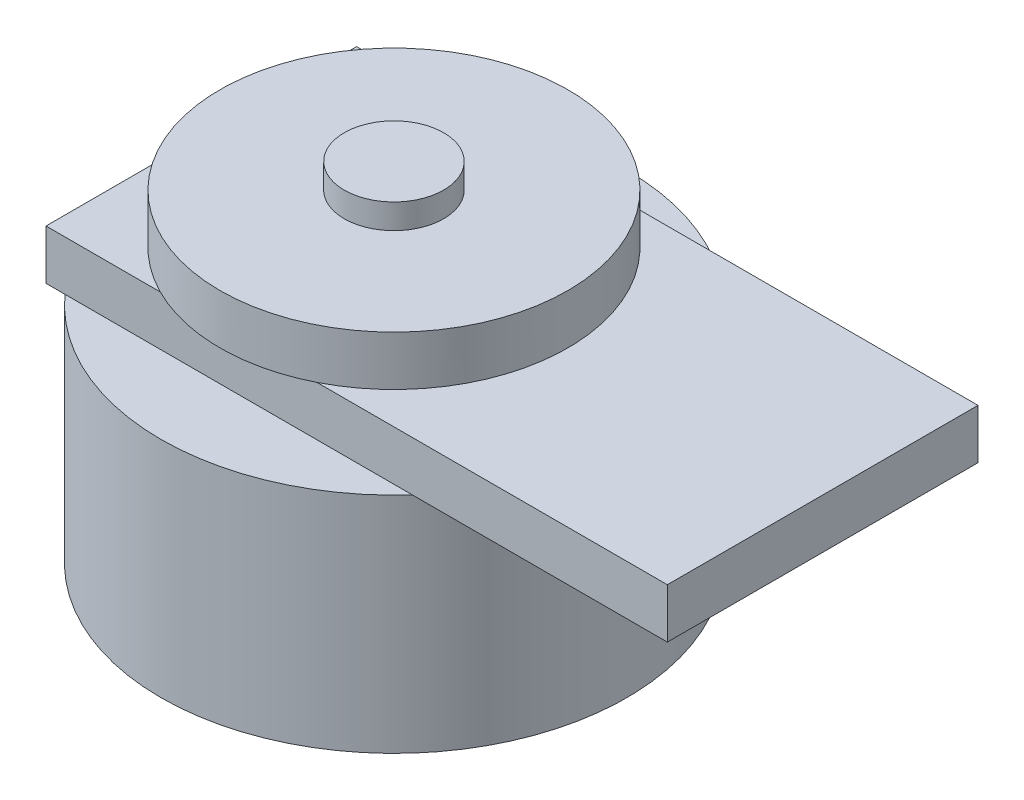
ISO-10303-21;
HEADER;
FILE_DESCRIPTION(('STEP AP214'),'2;1');
FILE_NAME('part.step','',(''),(''),'','','');
FILE_SCHEMA(('AUTOMOTIVE_DESIGN { 1 0 10303 214 1 1 1 1 }'));
ENDSEC;
DATA;
#1=APPLICATION_CONTEXT('core data for automotive mechanical design processes');
#2=APPLICATION_PROTOCOL_DEFINITION('international standard','automotive_design',2000,#1);
#3=PRODUCT_CONTEXT('',#1,'mechanical');
#4=PRODUCT('Part','Part','',(#3));
#5=PRODUCT_RELATED_PRODUCT_CATEGORY('part','',(#4));
#6=PRODUCT_DEFINITION_FORMATION('','',#4);
#7=PRODUCT_DEFINITION_CONTEXT('part definition',#1,'design');
#8=PRODUCT_DEFINITION('design','',#6,#7);
#9=PRODUCT_DEFINITION_SHAPE('','',#8);
#10=(LENGTH_UNIT() NAMED_UNIT(*) SI_UNIT(.MILLI.,.METRE.));
#11=(NAMED_UNIT(*) PLANE_ANGLE_UNIT() SI_UNIT($,.RADIAN.));
#12=(NAMED_UNIT(*) SI_UNIT($,.STERADIAN.) SOLID_ANGLE_UNIT());
#13=UNCERTAINTY_MEASURE_WITH_UNIT(LENGTH_MEASURE(1.E-05),#10,'distance_accuracy_value','');
#14=(GEOMETRIC_REPRESENTATION_CONTEXT(3) GLOBAL_UNCERTAINTY_ASSIGNED_CONTEXT((#13)) GLOBAL_UNIT_ASSIGNED_CONTEXT((#10,
#11,#12)) REPRESENTATION_CONTEXT('',''));
#15=CARTESIAN_POINT('',(0.,0.,0.));
#16=DIRECTION('',(0.,0.,1.));
#17=DIRECTION('',(1.,0.,0.));
#18=AXIS2_PLACEMENT_3D('',#15,#16,#17);
#19=CARTESIAN_POINT('',(0.,0.,0.));
#20=DIRECTION('',(0.,-1.,0.));
#21=DIRECTION('',(0.,0.,-1.));
#22=AXIS2_PLACEMENT_3D('',#19,#20,#21);
#23=PLANE('',#22);
#24=CARTESIAN_POINT('',(-9.5,0.,0.));
#25=DIRECTION('',(0.,-1.,0.));
#26=DIRECTION('',(0.,0.,-1.));
#27=AXIS2_PLACEMENT_3D('',#24,#25,#26);
#28=CIRCLE('',#27,18.75);
#29=CARTESIAN_POINT('',(4.47542485937369,0.,-12.5));
#30=VERTEX_POINT('',#29);
#31=CARTESIAN_POINT('',(4.47542485937369,0.,12.5));
#32=VERTEX_POINT('',#31);
#33=EDGE_CURVE('E138',#30,#32,#28,.T.);
#34=ORIENTED_EDGE('',*,*,#33,.F.);
#35=DIRECTION('',(-1.,0.,0.));
#36=VECTOR('',#35,1.);
#37=CARTESIAN_POINT('',(25.,0.,-12.5));
#38=LINE('',#37,#36);
#39=CARTESIAN_POINT('',(25.,0.,-12.5));
#40=VERTEX_POINT('',#39);
#41=EDGE_CURVE('E122',#40,#30,#38,.T.);
#42=ORIENTED_EDGE('',*,*,#41,.F.);
#43=DIRECTION('',(0.,0.,-1.));
#44=VECTOR('',#43,1.);
#45=CARTESIAN_POINT('',(25.,0.,12.5));
#46=LINE('',#45,#44);
#47=CARTESIAN_POINT('',(25.,0.,12.5));
#48=VERTEX_POINT('',#47);
#49=EDGE_CURVE('E173',#48,#40,#46,.T.);
#50=ORIENTED_EDGE('',*,*,#49,.F.);
#51=DIRECTION('',(-1.,0.,0.));
#52=VECTOR('',#51,1.);
#53=CARTESIAN_POINT('',(25.,0.,12.5));
#54=LINE('',#53,#52);
#55=EDGE_CURVE('E168',#48,#32,#54,.T.);
#56=ORIENTED_EDGE('',*,*,#55,.T.);
#57=EDGE_LOOP('',(#34,#42,#50,#56));
#58=FACE_BOUND('',#57,.T.);
#59=ADVANCED_FACE('F39',(#58),#23,.T.);
#60=CARTESIAN_POINT('',(-23.4754248593737,0.,12.5));
#61=VERTEX_POINT('',#60);
#62=CARTESIAN_POINT('',(-25.,0.,10.5504739230046));
#63=VERTEX_POINT('',#62);
#64=EDGE_CURVE('E11',#61,#63,#28,.T.);
#65=ORIENTED_EDGE('',*,*,#64,.F.);
#66=CARTESIAN_POINT('',(-25.,0.,12.5));
#67=VERTEX_POINT('',#66);
#68=EDGE_CURVE('E169',#61,#67,#54,.T.);
#69=ORIENTED_EDGE('',*,*,#68,.T.);
#70=DIRECTION('',(0.,0.,-1.));
#71=VECTOR('',#70,1.);
#72=CARTESIAN_POINT('',(-25.,0.,12.5));
#73=LINE('',#72,#71);
#74=EDGE_CURVE('E174',#67,#63,#73,.T.);
#75=ORIENTED_EDGE('',*,*,#74,.T.);
#76=EDGE_LOOP('',(#65,#69,#75));
#77=FACE_BOUND('',#76,.T.);
#78=ADVANCED_FACE('F252',(#77),#23,.T.);
#79=CARTESIAN_POINT('',(0.,4.,0.));
#80=DIRECTION('',(0.,-1.,0.));
#81=DIRECTION('',(0.,0.,-1.));
#82=AXIS2_PLACEMENT_3D('',#79,#80,#81);
#83=PLANE('',#82);
#84=CARTESIAN_POINT('',(-9.5,4.,0.));
#85=DIRECTION('',(0.,1.,0.));
#86=DIRECTION('',(0.,0.,1.));
#87=AXIS2_PLACEMENT_3D('',#84,#85,#86);
#88=CIRCLE('',#87,14.);
#89=CARTESIAN_POINT('',(-3.19523989354075,4.,12.5));
#90=VERTEX_POINT('',#89);
#91=CARTESIAN_POINT('',(-3.19523989354075,4.,-12.5));
#92=VERTEX_POINT('',#91);
#93=EDGE_CURVE('E195',#90,#92,#88,.T.);
#94=ORIENTED_EDGE('',*,*,#93,.F.);
#95=DIRECTION('',(-1.,0.,0.));
#96=VECTOR('',#95,1.);
#97=CARTESIAN_POINT('',(25.,4.,12.5));
#98=LINE('',#97,#96);
#99=CARTESIAN_POINT('',(25.,4.,12.5));
#100=VERTEX_POINT('',#99);
#101=EDGE_CURVE('E228',#100,#90,#98,.T.);
#102=ORIENTED_EDGE('',*,*,#101,.F.);
#103=DIRECTION('',(0.,0.,-1.));
#104=VECTOR('',#103,1.);
#105=CARTESIAN_POINT('',(25.,4.,12.5));
#106=LINE('',#105,#104);
#107=CARTESIAN_POINT('',(25.,4.,-12.5));
#108=VERTEX_POINT('',#107);
#109=EDGE_CURVE('E184',#100,#108,#106,.T.);
#110=ORIENTED_EDGE('',*,*,#109,.T.);
#111=DIRECTION('',(-1.,0.,0.));
#112=VECTOR('',#111,1.);
#113=CARTESIAN_POINT('',(25.,4.,-12.5));
#114=LINE('',#113,#112);
#115=EDGE_CURVE('E230',#108,#92,#114,.T.);
#116=ORIENTED_EDGE('',*,*,#115,.T.);
#117=EDGE_LOOP('',(#94,#102,#110,#116));
#118=FACE_BOUND('',#117,.T.);
#119=ADVANCED_FACE('F227',(#118),#83,.F.);
#120=CARTESIAN_POINT('',(25.,4.,-12.5));
#121=DIRECTION('',(0.,0.,1.));
#122=DIRECTION('',(1.,0.,0.));
#123=AXIS2_PLACEMENT_3D('',#120,#121,#122);
#124=PLANE('',#123);
#125=ORIENTED_EDGE('',*,*,#41,.T.);
#126=CARTESIAN_POINT('',(-23.4754248593737,0.,-12.5));
#127=VERTEX_POINT('',#126);
#128=EDGE_CURVE('E116',#30,#127,#38,.T.);
#129=ORIENTED_EDGE('',*,*,#128,.T.);
#130=CARTESIAN_POINT('',(-25.,0.,-12.5));
#131=VERTEX_POINT('',#130);
#132=EDGE_CURVE('E118',#127,#131,#38,.T.);
#133=ORIENTED_EDGE('',*,*,#132,.T.);
#134=DIRECTION('',(0.,-1.,0.));
#135=VECTOR('',#134,1.);
#136=CARTESIAN_POINT('',(-25.,4.,-12.5));
#137=LINE('',#136,#135);
#138=CARTESIAN_POINT('',(-25.,4.,-12.5));
#139=VERTEX_POINT('',#138);
#140=EDGE_CURVE('E43',#139,#131,#137,.T.);
#141=ORIENTED_EDGE('',*,*,#140,.F.);
#142=CARTESIAN_POINT('',(-15.8047601064592,4.,-12.5));
#143=VERTEX_POINT('',#142);
#144=EDGE_CURVE('E179',#143,#139,#114,.T.);
#145=ORIENTED_EDGE('',*,*,#144,.F.);
#146=EDGE_CURVE('E425',#92,#143,#114,.T.);
#147=ORIENTED_EDGE('',*,*,#146,.F.);
#148=ORIENTED_EDGE('',*,*,#115,.F.);
#149=DIRECTION('',(0.,-1.,0.));
#150=VECTOR('',#149,1.);
#151=CARTESIAN_POINT('',(25.,4.,-12.5));
#152=LINE('',#151,#150);
#153=EDGE_CURVE('E180',#108,#40,#152,.T.);
#154=ORIENTED_EDGE('',*,*,#153,.T.);
#155=EDGE_LOOP('',(#125,#129,#133,#141,#145,#147,#148,#154));
#156=FACE_BOUND('',#155,.T.);
#157=ADVANCED_FACE('F41',(#156),#124,.F.);
#158=CARTESIAN_POINT('',(-25.,4.,12.5));
#159=DIRECTION('',(-1.,0.,0.));
#160=DIRECTION('',(0.,0.,1.));
#161=AXIS2_PLACEMENT_3D('',#158,#159,#160);
#162=PLANE('',#161);
#163=ORIENTED_EDGE('',*,*,#74,.F.);
#164=DIRECTION('',(0.,-1.,0.));
#165=VECTOR('',#164,1.);
#166=CARTESIAN_POINT('',(-25.,4.,12.5));
#167=LINE('',#166,#165);
#168=CARTESIAN_POINT('',(-25.,4.,12.5));
#169=VERTEX_POINT('',#168);
#170=EDGE_CURVE('E186',#169,#67,#167,.T.);
#171=ORIENTED_EDGE('',*,*,#170,.F.);
#172=DIRECTION('',(0.,0.,-1.));
#173=VECTOR('',#172,1.);
#174=CARTESIAN_POINT('',(-25.,4.,12.5));
#175=LINE('',#174,#173);
#176=EDGE_CURVE('E243',#169,#139,#175,.T.);
#177=ORIENTED_EDGE('',*,*,#176,.T.);
#178=ORIENTED_EDGE('',*,*,#140,.T.);
#179=CARTESIAN_POINT('',(-25.,0.,-10.5504739230046));
#180=VERTEX_POINT('',#179);
#181=EDGE_CURVE('E129',#180,#131,#73,.T.);
#182=ORIENTED_EDGE('',*,*,#181,.F.);
#183=EDGE_CURVE('E64',#63,#180,#73,.T.);
#184=ORIENTED_EDGE('',*,*,#183,.F.);
#185=EDGE_LOOP('',(#163,#171,#177,#178,#182,#184));
#186=FACE_BOUND('',#185,.T.);
#187=ADVANCED_FACE('F293',(#186),#162,.T.);
#188=CARTESIAN_POINT('',(25.,4.,12.5));
#189=DIRECTION('',(0.,0.,1.));
#190=DIRECTION('',(1.,0.,0.));
#191=AXIS2_PLACEMENT_3D('',#188,#189,#190);
#192=PLANE('',#191);
#193=ORIENTED_EDGE('',*,*,#55,.F.);
#194=DIRECTION('',(0.,-1.,0.));
#195=VECTOR('',#194,1.);
#196=CARTESIAN_POINT('',(25.,4.,12.5));
#197=LINE('',#196,#195);
#198=EDGE_CURVE('E183',#100,#48,#197,.T.);
#199=ORIENTED_EDGE('',*,*,#198,.F.);
#200=ORIENTED_EDGE('',*,*,#101,.T.);
#201=CARTESIAN_POINT('',(-15.8047601064592,4.,12.5));
#202=VERTEX_POINT('',#201);
#203=EDGE_CURVE('E233',#90,#202,#98,.T.);
#204=ORIENTED_EDGE('',*,*,#203,.T.);
#205=EDGE_CURVE('E238',#202,#169,#98,.T.);
#206=ORIENTED_EDGE('',*,*,#205,.T.);
#207=ORIENTED_EDGE('',*,*,#170,.T.);
#208=ORIENTED_EDGE('',*,*,#68,.F.);
#209=EDGE_CURVE('E162',#32,#61,#54,.T.);
#210=ORIENTED_EDGE('',*,*,#209,.F.);
#211=EDGE_LOOP('',(#193,#199,#200,#204,#206,#207,#208,#210));
#212=FACE_BOUND('',#211,.T.);
#213=ADVANCED_FACE('F232',(#212),#192,.T.);
#214=CARTESIAN_POINT('',(25.,4.,12.5));
#215=DIRECTION('',(-1.,0.,0.));
#216=DIRECTION('',(0.,0.,1.));
#217=AXIS2_PLACEMENT_3D('',#214,#215,#216);
#218=PLANE('',#217);
#219=ORIENTED_EDGE('',*,*,#49,.T.);
#220=ORIENTED_EDGE('',*,*,#153,.F.);
#221=ORIENTED_EDGE('',*,*,#109,.F.);
#222=ORIENTED_EDGE('',*,*,#198,.T.);
#223=EDGE_LOOP('',(#219,#220,#221,#222));
#224=FACE_BOUND('',#223,.T.);
#225=ADVANCED_FACE('F283',(#224),#218,.F.);
#226=EDGE_CURVE('E146',#143,#202,#88,.T.);
#227=ORIENTED_EDGE('',*,*,#226,.F.);
#228=ORIENTED_EDGE('',*,*,#144,.T.);
#229=ORIENTED_EDGE('',*,*,#176,.F.);
#230=ORIENTED_EDGE('',*,*,#205,.F.);
#231=EDGE_LOOP('',(#227,#228,#229,#230));
#232=FACE_BOUND('',#231,.T.);
#233=ADVANCED_FACE('F276',(#232),#83,.F.);
#234=EDGE_CURVE('E49',#180,#127,#28,.T.);
#235=ORIENTED_EDGE('',*,*,#234,.F.);
#236=ORIENTED_EDGE('',*,*,#181,.T.);
#237=ORIENTED_EDGE('',*,*,#132,.F.);
#238=EDGE_LOOP('',(#235,#236,#237));
#239=FACE_BOUND('',#238,.T.);
#240=ADVANCED_FACE('F128',(#239),#23,.T.);
#241=CARTESIAN_POINT('',(-9.5,4.,0.));
#242=DIRECTION('',(0.,1.,0.));
#243=DIRECTION('',(0.,0.,1.));
#244=AXIS2_PLACEMENT_3D('',#241,#242,#243);
#245=PLANE('',#244);
#246=EDGE_CURVE('E196',#92,#143,#88,.T.);
#247=ORIENTED_EDGE('',*,*,#246,.F.);
#248=ORIENTED_EDGE('',*,*,#146,.T.);
#249=EDGE_LOOP('',(#247,#248));
#250=FACE_BOUND('',#249,.T.);
#251=ADVANCED_FACE('F221',(#250),#245,.F.);
#252=CARTESIAN_POINT('',(-9.5,8.,0.));
#253=DIRECTION('',(0.,-1.,0.));
#254=DIRECTION('',(0.,0.,-1.));
#255=AXIS2_PLACEMENT_3D('',#252,#253,#254);
#256=CYLINDRICAL_SURFACE('',#255,14.);
#257=CARTESIAN_POINT('',(-9.5,8.,0.));
#258=DIRECTION('',(0.,1.,0.));
#259=DIRECTION('',(0.,0.,1.));
#260=AXIS2_PLACEMENT_3D('',#257,#258,#259);
#261=CIRCLE('',#260,14.);
#262=CARTESIAN_POINT('',(-9.5,8.,14.));
#263=VERTEX_POINT('',#262);
#264=EDGE_CURVE('E131',#263,#263,#261,.T.);
#265=ORIENTED_EDGE('',*,*,#264,.F.);
#266=EDGE_LOOP('',(#265));
#267=FACE_BOUND('',#266,.T.);
#268=ORIENTED_EDGE('',*,*,#93,.T.);
#269=ORIENTED_EDGE('',*,*,#246,.T.);
#270=ORIENTED_EDGE('',*,*,#226,.T.);
#271=EDGE_CURVE('E204',#202,#90,#88,.T.);
#272=ORIENTED_EDGE('',*,*,#271,.T.);
#273=EDGE_LOOP('',(#268,#269,#270,#272));
#274=FACE_BOUND('',#273,.T.);
#275=ADVANCED_FACE('F219',(#267,#274),#256,.T.);
#276=CARTESIAN_POINT('',(-9.5,8.,0.));
#277=DIRECTION('',(0.,1.,0.));
#278=DIRECTION('',(0.,0.,1.));
#279=AXIS2_PLACEMENT_3D('',#276,#277,#278);
#280=PLANE('',#279);
#281=CARTESIAN_POINT('',(-9.5,8.,0.));
#282=DIRECTION('',(0.,1.,0.));
#283=DIRECTION('',(0.,0.,1.));
#284=AXIS2_PLACEMENT_3D('',#281,#282,#283);
#285=CIRCLE('',#284,4.);
#286=CARTESIAN_POINT('',(-9.5,8.,4.));
#287=VERTEX_POINT('',#286);
#288=EDGE_CURVE('E143',#287,#287,#285,.T.);
#289=ORIENTED_EDGE('',*,*,#288,.F.);
#290=EDGE_LOOP('',(#289));
#291=FACE_BOUND('',#290,.T.);
#292=ORIENTED_EDGE('',*,*,#264,.T.);
#293=EDGE_LOOP('',(#292));
#294=FACE_BOUND('',#293,.T.);
#295=ADVANCED_FACE('F217',(#291,#294),#280,.T.);
#296=ORIENTED_EDGE('',*,*,#203,.F.);
#297=ORIENTED_EDGE('',*,*,#271,.F.);
#298=EDGE_LOOP('',(#296,#297));
#299=FACE_BOUND('',#298,.T.);
#300=ADVANCED_FACE('F240',(#299),#245,.F.);
#301=CARTESIAN_POINT('',(-9.5,10.,0.));
#302=DIRECTION('',(0.,-1.,0.));
#303=DIRECTION('',(0.,0.,-1.));
#304=AXIS2_PLACEMENT_3D('',#301,#302,#303);
#305=CYLINDRICAL_SURFACE('',#304,4.);
#306=CARTESIAN_POINT('',(-9.5,10.,0.));
#307=DIRECTION('',(0.,1.,0.));
#308=DIRECTION('',(0.,0.,1.));
#309=AXIS2_PLACEMENT_3D('',#306,#307,#308);
#310=CIRCLE('',#309,4.);
#311=CARTESIAN_POINT('',(-9.5,10.,4.));
#312=VERTEX_POINT('',#311);
#313=EDGE_CURVE('E156',#312,#312,#310,.T.);
#314=ORIENTED_EDGE('',*,*,#313,.F.);
#315=EDGE_LOOP('',(#314));
#316=FACE_BOUND('',#315,.T.);
#317=ORIENTED_EDGE('',*,*,#288,.T.);
#318=EDGE_LOOP('',(#317));
#319=FACE_BOUND('',#318,.T.);
#320=ADVANCED_FACE('F339',(#316,#319),#305,.T.);
#321=CARTESIAN_POINT('',(-9.5,10.,0.));
#322=DIRECTION('',(0.,1.,0.));
#323=DIRECTION('',(0.,0.,1.));
#324=AXIS2_PLACEMENT_3D('',#321,#322,#323);
#325=PLANE('',#324);
#326=ORIENTED_EDGE('',*,*,#313,.T.);
#327=EDGE_LOOP('',(#326));
#328=FACE_BOUND('',#327,.T.);
#329=ADVANCED_FACE('F264',(#328),#325,.T.);
#330=CARTESIAN_POINT('',(-9.5,0.,0.));
#331=DIRECTION('',(0.,-1.,0.));
#332=DIRECTION('',(0.,0.,-1.));
#333=AXIS2_PLACEMENT_3D('',#330,#331,#332);
#334=PLANE('',#333);
#335=EDGE_CURVE('E51',#32,#61,#28,.T.);
#336=ORIENTED_EDGE('',*,*,#335,.F.);
#337=ORIENTED_EDGE('',*,*,#209,.T.);
#338=EDGE_LOOP('',(#336,#337));
#339=FACE_BOUND('',#338,.T.);
#340=ADVANCED_FACE('F161',(#339),#334,.F.);
#341=EDGE_CURVE('E137',#63,#180,#28,.T.);
#342=ORIENTED_EDGE('',*,*,#341,.F.);
#343=ORIENTED_EDGE('',*,*,#183,.T.);
#344=EDGE_LOOP('',(#342,#343));
#345=FACE_BOUND('',#344,.T.);
#346=ADVANCED_FACE('F254',(#345),#334,.F.);
#347=CARTESIAN_POINT('',(-9.5,-18.,0.));
#348=DIRECTION('',(0.,1.,0.));
#349=DIRECTION('',(0.,0.,1.));
#350=AXIS2_PLACEMENT_3D('',#347,#348,#349);
#351=CYLINDRICAL_SURFACE('',#350,18.75);
#352=CARTESIAN_POINT('',(-9.5,-18.,0.));
#353=DIRECTION('',(0.,-1.,0.));
#354=DIRECTION('',(0.,0.,-1.));
#355=AXIS2_PLACEMENT_3D('',#352,#353,#354);
#356=CIRCLE('',#355,18.75);
#357=CARTESIAN_POINT('',(-9.5,-18.,-18.75));
#358=VERTEX_POINT('',#357);
#359=EDGE_CURVE('E151',#358,#358,#356,.T.);
#360=ORIENTED_EDGE('',*,*,#359,.F.);
#361=EDGE_LOOP('',(#360));
#362=FACE_BOUND('',#361,.T.);
#363=ORIENTED_EDGE('',*,*,#33,.T.);
#364=ORIENTED_EDGE('',*,*,#335,.T.);
#365=ORIENTED_EDGE('',*,*,#64,.T.);
#366=ORIENTED_EDGE('',*,*,#341,.T.);
#367=ORIENTED_EDGE('',*,*,#234,.T.);
#368=EDGE_CURVE('E132',#127,#30,#28,.T.);
#369=ORIENTED_EDGE('',*,*,#368,.T.);
#370=EDGE_LOOP('',(#363,#364,#365,#366,#367,#369));
#371=FACE_BOUND('',#370,.T.);
#372=ADVANCED_FACE('F140',(#362,#371),#351,.T.);
#373=CARTESIAN_POINT('',(-9.5,-18.,0.));
#374=DIRECTION('',(0.,-1.,0.));
#375=DIRECTION('',(0.,0.,-1.));
#376=AXIS2_PLACEMENT_3D('',#373,#374,#375);
#377=PLANE('',#376);
#378=ORIENTED_EDGE('',*,*,#359,.T.);
#379=EDGE_LOOP('',(#378));
#380=FACE_BOUND('',#379,.T.);
#381=ADVANCED_FACE('F261',(#380),#377,.T.);
#382=ORIENTED_EDGE('',*,*,#128,.F.);
#383=ORIENTED_EDGE('',*,*,#368,.F.);
#384=EDGE_LOOP('',(#382,#383));
#385=FACE_BOUND('',#384,.T.);
#386=ADVANCED_FACE('F133',(#385),#334,.F.);
#387=CLOSED_SHELL('',(#59,#78,#119,#157,#187,#213,#225,#233,#240,#251,#275,#295,#300,#320,#329,
#340,#346,#372,#381,#386));
#388=MANIFOLD_SOLID_BREP('B2',#387);
#389=ADVANCED_BREP_SHAPE_REPRESENTATION('',(#18,#388),#14);
#390=SHAPE_DEFINITION_REPRESENTATION(#9,#389);
ENDSEC;
END-ISO-10303-21;
